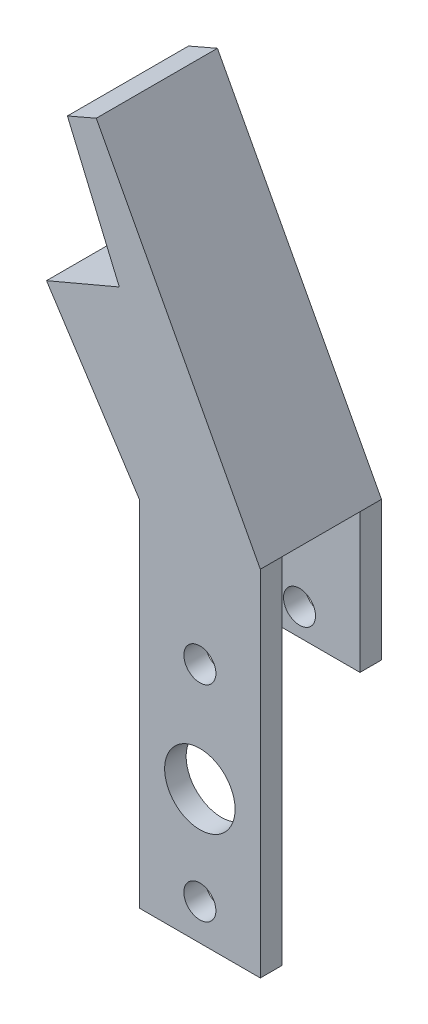
ISO-10303-21;
HEADER;
FILE_DESCRIPTION(('STEP AP214'),'2;1');
FILE_NAME('part.step','',(''),(''),'','','');
FILE_SCHEMA(('AUTOMOTIVE_DESIGN { 1 0 10303 214 1 1 1 1 }'));
ENDSEC;
DATA;
#1=APPLICATION_CONTEXT('core data for automotive mechanical design processes');
#2=APPLICATION_PROTOCOL_DEFINITION('international standard','automotive_design',2000,#1);
#3=PRODUCT_CONTEXT('',#1,'mechanical');
#4=PRODUCT('Part','Part','',(#3));
#5=PRODUCT_RELATED_PRODUCT_CATEGORY('part','',(#4));
#6=PRODUCT_DEFINITION_FORMATION('','',#4);
#7=PRODUCT_DEFINITION_CONTEXT('part definition',#1,'design');
#8=PRODUCT_DEFINITION('design','',#6,#7);
#9=PRODUCT_DEFINITION_SHAPE('','',#8);
#10=(LENGTH_UNIT() NAMED_UNIT(*) SI_UNIT(.MILLI.,.METRE.));
#11=(NAMED_UNIT(*) PLANE_ANGLE_UNIT() SI_UNIT($,.RADIAN.));
#12=(NAMED_UNIT(*) SI_UNIT($,.STERADIAN.) SOLID_ANGLE_UNIT());
#13=UNCERTAINTY_MEASURE_WITH_UNIT(LENGTH_MEASURE(1.E-05),#10,'distance_accuracy_value','');
#14=(GEOMETRIC_REPRESENTATION_CONTEXT(3) GLOBAL_UNCERTAINTY_ASSIGNED_CONTEXT((#13)) GLOBAL_UNIT_ASSIGNED_CONTEXT((#10,
#11,#12)) REPRESENTATION_CONTEXT('',''));
#15=CARTESIAN_POINT('',(0.,0.,0.));
#16=DIRECTION('',(0.,0.,1.));
#17=DIRECTION('',(1.,0.,0.));
#18=AXIS2_PLACEMENT_3D('',#15,#16,#17);
#19=CARTESIAN_POINT('',(-1.59169242895809,-17.7894769762298,14.3256));
#20=DIRECTION('',(1.,0.,0.));
#21=DIRECTION('',(0.,0.,-1.));
#22=AXIS2_PLACEMENT_3D('',#19,#20,#21);
#23=PLANE('',#22);
#24=DIRECTION('',(0.,-1.,0.));
#25=VECTOR('',#24,1.);
#26=CARTESIAN_POINT('',(-1.59169242895809,-17.7894769762298,0.));
#27=LINE('',#26,#25);
#28=CARTESIAN_POINT('',(-1.59169242895809,24.0697230237702,0.));
#29=VERTEX_POINT('',#28);
#30=CARTESIAN_POINT('',(-1.59169242895809,7.61052302377023,0.));
#31=VERTEX_POINT('',#30);
#32=EDGE_CURVE('E143',#29,#31,#27,.T.);
#33=ORIENTED_EDGE('',*,*,#32,.T.);
#34=DIRECTION('',(0.,0.,1.));
#35=VECTOR('',#34,1.);
#36=CARTESIAN_POINT('',(-1.59169242895809,7.61052302377023,14.3256));
#37=LINE('',#36,#35);
#38=CARTESIAN_POINT('',(-1.59169242895809,7.61052302377023,2.54));
#39=VERTEX_POINT('',#38);
#40=EDGE_CURVE('E123',#31,#39,#37,.T.);
#41=ORIENTED_EDGE('',*,*,#40,.T.);
#42=DIRECTION('',(0.,-1.,0.));
#43=VECTOR('',#42,1.);
#44=CARTESIAN_POINT('',(-1.59169242895809,-17.7894769762298,2.54));
#45=LINE('',#44,#43);
#46=CARTESIAN_POINT('',(-1.59169242895809,24.0697230237702,2.54000000000001));
#47=VERTEX_POINT('',#46);
#48=EDGE_CURVE('E147',#47,#39,#45,.T.);
#49=ORIENTED_EDGE('',*,*,#48,.F.);
#50=DIRECTION('',(0.,0.,-1.));
#51=VECTOR('',#50,1.);
#52=CARTESIAN_POINT('',(-1.59169242895809,24.0697230237702,14.3256));
#53=LINE('',#52,#51);
#54=EDGE_CURVE('E165',#47,#29,#53,.T.);
#55=ORIENTED_EDGE('',*,*,#54,.T.);
#56=EDGE_LOOP('',(#33,#41,#49,#55));
#57=FACE_BOUND('',#56,.T.);
#58=ADVANCED_FACE('F33',(#57),#23,.F.);
#59=DIRECTION('',(0.,1.,0.));
#60=VECTOR('',#59,1.);
#61=CARTESIAN_POINT('',(-1.59169242895809,-17.7894769762298,11.7856));
#62=LINE('',#61,#60);
#63=CARTESIAN_POINT('',(-1.59169242895809,-17.7894769762298,11.7856));
#64=VERTEX_POINT('',#63);
#65=CARTESIAN_POINT('',(-1.59169242895809,24.0697230237702,11.7856));
#66=VERTEX_POINT('',#65);
#67=EDGE_CURVE('E219',#64,#66,#62,.T.);
#68=ORIENTED_EDGE('',*,*,#67,.F.);
#69=DIRECTION('',(0.,0.,-1.));
#70=VECTOR('',#69,1.);
#71=CARTESIAN_POINT('',(-1.59169242895809,-17.7894769762298,14.3256));
#72=LINE('',#71,#70);
#73=CARTESIAN_POINT('',(-1.59169242895809,-17.7894769762298,14.3256));
#74=VERTEX_POINT('',#73);
#75=EDGE_CURVE('E41',#74,#64,#72,.T.);
#76=ORIENTED_EDGE('',*,*,#75,.F.);
#77=DIRECTION('',(0.,-1.,0.));
#78=VECTOR('',#77,1.);
#79=CARTESIAN_POINT('',(-1.59169242895809,-17.7894769762298,14.3256));
#80=LINE('',#79,#78);
#81=CARTESIAN_POINT('',(-1.59169242895809,24.0697230237702,14.3256));
#82=VERTEX_POINT('',#81);
#83=EDGE_CURVE('E159',#82,#74,#80,.T.);
#84=ORIENTED_EDGE('',*,*,#83,.F.);
#85=EDGE_CURVE('E160',#82,#66,#53,.T.);
#86=ORIENTED_EDGE('',*,*,#85,.T.);
#87=EDGE_LOOP('',(#68,#76,#84,#86));
#88=FACE_BOUND('',#87,.T.);
#89=ADVANCED_FACE('F285',(#88),#23,.F.);
#90=CARTESIAN_POINT('',(-1.59169242895809,-17.7894769762298,14.3256));
#91=DIRECTION('',(0.,1.,0.));
#92=DIRECTION('',(0.,0.,1.));
#93=AXIS2_PLACEMENT_3D('',#90,#91,#92);
#94=PLANE('',#93);
#95=DIRECTION('',(1.,0.,0.));
#96=VECTOR('',#95,1.);
#97=CARTESIAN_POINT('',(-1.61709242895809,-17.7894769762298,11.7856));
#98=LINE('',#97,#96);
#99=CARTESIAN_POINT('',(12.7085075710419,-17.7894769762298,11.7856));
#100=VERTEX_POINT('',#99);
#101=EDGE_CURVE('E216',#64,#100,#98,.T.);
#102=ORIENTED_EDGE('',*,*,#101,.T.);
#103=DIRECTION('',(0.,0.,-1.));
#104=VECTOR('',#103,1.);
#105=CARTESIAN_POINT('',(12.7085075710419,-17.7894769762298,14.3256));
#106=LINE('',#105,#104);
#107=CARTESIAN_POINT('',(12.7085075710419,-17.7894769762298,14.3256));
#108=VERTEX_POINT('',#107);
#109=EDGE_CURVE('E181',#108,#100,#106,.T.);
#110=ORIENTED_EDGE('',*,*,#109,.F.);
#111=DIRECTION('',(1.,0.,0.));
#112=VECTOR('',#111,1.);
#113=CARTESIAN_POINT('',(-1.59169242895809,-17.7894769762298,14.3256));
#114=LINE('',#113,#112);
#115=EDGE_CURVE('E227',#74,#108,#114,.T.);
#116=ORIENTED_EDGE('',*,*,#115,.F.);
#117=ORIENTED_EDGE('',*,*,#75,.T.);
#118=EDGE_LOOP('',(#102,#110,#116,#117));
#119=FACE_BOUND('',#118,.T.);
#120=ADVANCED_FACE('F281',(#119),#94,.F.);
#121=CARTESIAN_POINT('',(12.7085075710419,-17.7894769762298,14.3256));
#122=DIRECTION('',(-1.,0.,0.));
#123=DIRECTION('',(0.,0.,1.));
#124=AXIS2_PLACEMENT_3D('',#121,#122,#123);
#125=PLANE('',#124);
#126=DIRECTION('',(0.,-1.,0.));
#127=VECTOR('',#126,1.);
#128=CARTESIAN_POINT('',(12.7085075710419,0.,2.54));
#129=LINE('',#128,#127);
#130=CARTESIAN_POINT('',(12.7085075710419,24.0697230237702,2.54000000000001));
#131=VERTEX_POINT('',#130);
#132=CARTESIAN_POINT('',(12.7085075710419,7.61052302377023,2.54));
#133=VERTEX_POINT('',#132);
#134=EDGE_CURVE('E136',#131,#133,#129,.T.);
#135=ORIENTED_EDGE('',*,*,#134,.T.);
#136=DIRECTION('',(0.,0.,1.));
#137=VECTOR('',#136,1.);
#138=CARTESIAN_POINT('',(12.7085075710419,7.61052302377023,0.));
#139=LINE('',#138,#137);
#140=CARTESIAN_POINT('',(12.7085075710419,7.61052302377023,0.));
#141=VERTEX_POINT('',#140);
#142=EDGE_CURVE('E48',#141,#133,#139,.T.);
#143=ORIENTED_EDGE('',*,*,#142,.F.);
#144=DIRECTION('',(0.,1.,0.));
#145=VECTOR('',#144,1.);
#146=CARTESIAN_POINT('',(12.7085075710419,-17.7894769762298,0.));
#147=LINE('',#146,#145);
#148=CARTESIAN_POINT('',(12.7085075710419,24.0697230237702,0.));
#149=VERTEX_POINT('',#148);
#150=EDGE_CURVE('E133',#141,#149,#147,.T.);
#151=ORIENTED_EDGE('',*,*,#150,.T.);
#152=DIRECTION('',(0.,0.,-1.));
#153=VECTOR('',#152,1.);
#154=CARTESIAN_POINT('',(12.7085075710419,24.0697230237702,14.3256));
#155=LINE('',#154,#153);
#156=EDGE_CURVE('E177',#131,#149,#155,.T.);
#157=ORIENTED_EDGE('',*,*,#156,.F.);
#158=EDGE_LOOP('',(#135,#143,#151,#157));
#159=FACE_BOUND('',#158,.T.);
#160=ADVANCED_FACE('F131',(#159),#125,.F.);
#161=DIRECTION('',(0.,1.,0.));
#162=VECTOR('',#161,1.);
#163=CARTESIAN_POINT('',(12.7085075710419,0.,11.7856));
#164=LINE('',#163,#162);
#165=CARTESIAN_POINT('',(12.7085075710419,24.0697230237702,11.7856));
#166=VERTEX_POINT('',#165);
#167=EDGE_CURVE('E212',#100,#166,#164,.T.);
#168=ORIENTED_EDGE('',*,*,#167,.T.);
#169=CARTESIAN_POINT('',(12.7085075710419,24.0697230237702,14.3256));
#170=VERTEX_POINT('',#169);
#171=EDGE_CURVE('E178',#170,#166,#155,.T.);
#172=ORIENTED_EDGE('',*,*,#171,.F.);
#173=DIRECTION('',(0.,1.,0.));
#174=VECTOR('',#173,1.);
#175=CARTESIAN_POINT('',(12.7085075710419,-17.7894769762298,14.3256));
#176=LINE('',#175,#174);
#177=EDGE_CURVE('E229',#108,#170,#176,.T.);
#178=ORIENTED_EDGE('',*,*,#177,.F.);
#179=ORIENTED_EDGE('',*,*,#109,.T.);
#180=EDGE_LOOP('',(#168,#172,#178,#179));
#181=FACE_BOUND('',#180,.T.);
#182=ADVANCED_FACE('F274',(#181),#125,.F.);
#183=CARTESIAN_POINT('',(12.7085075710419,24.0697230237702,14.3256));
#184=DIRECTION('',(-0.882947592858925,-0.469471562785895,0.));
#185=DIRECTION('',(0.469471562785895,-0.882947592858925,0.));
#186=AXIS2_PLACEMENT_3D('',#183,#184,#185);
#187=PLANE('',#186);
#188=DIRECTION('',(-0.469471562785895,0.882947592858924,0.));
#189=VECTOR('',#188,1.);
#190=CARTESIAN_POINT('',(12.7085075710419,24.0697230237702,0.));
#191=LINE('',#190,#189);
#192=CARTESIAN_POINT('',(-6.69278033833544,60.5582386567396,0.));
#193=VERTEX_POINT('',#192);
#194=EDGE_CURVE('E142',#149,#193,#191,.T.);
#195=ORIENTED_EDGE('',*,*,#194,.T.);
#196=DIRECTION('',(0.,0.,-1.));
#197=VECTOR('',#196,1.);
#198=CARTESIAN_POINT('',(-6.69278033833544,60.5582386567396,14.3256));
#199=LINE('',#198,#197);
#200=CARTESIAN_POINT('',(-6.69278033833544,60.5582386567396,14.3256));
#201=VERTEX_POINT('',#200);
#202=EDGE_CURVE('E174',#201,#193,#199,.T.);
#203=ORIENTED_EDGE('',*,*,#202,.F.);
#204=DIRECTION('',(-0.469471562785895,0.882947592858924,0.));
#205=VECTOR('',#204,1.);
#206=CARTESIAN_POINT('',(12.7085075710419,24.0697230237702,14.3256));
#207=LINE('',#206,#205);
#208=EDGE_CURVE('E231',#170,#201,#207,.T.);
#209=ORIENTED_EDGE('',*,*,#208,.F.);
#210=ORIENTED_EDGE('',*,*,#171,.T.);
#211=DIRECTION('',(0.,0.,1.));
#212=VECTOR('',#211,1.);
#213=CARTESIAN_POINT('',(12.7085075710419,24.0697230237702,0.));
#214=LINE('',#213,#212);
#215=EDGE_CURVE('E210',#131,#166,#214,.T.);
#216=ORIENTED_EDGE('',*,*,#215,.F.);
#217=ORIENTED_EDGE('',*,*,#156,.T.);
#218=EDGE_LOOP('',(#195,#203,#209,#210,#216,#217));
#219=FACE_BOUND('',#218,.T.);
#220=ADVANCED_FACE('F270',(#219),#187,.F.);
#221=CARTESIAN_POINT('',(-10.1049963354584,59.0852863596951,14.3256));
#222=DIRECTION('',(0.396321577939323,-0.9181117616389,0.));
#223=DIRECTION('',(0.9181117616389,0.396321577939323,0.));
#224=AXIS2_PLACEMENT_3D('',#221,#222,#223);
#225=PLANE('',#224);
#226=DIRECTION('',(-0.9181117616389,-0.396321577939323,0.));
#227=VECTOR('',#226,1.);
#228=CARTESIAN_POINT('',(-10.1049963354584,59.0852863596951,0.));
#229=LINE('',#228,#227);
#230=CARTESIAN_POINT('',(-10.1049963354584,59.0852863596951,0.));
#231=VERTEX_POINT('',#230);
#232=EDGE_CURVE('E145',#193,#231,#229,.T.);
#233=ORIENTED_EDGE('',*,*,#232,.T.);
#234=DIRECTION('',(0.,0.,-1.));
#235=VECTOR('',#234,1.);
#236=CARTESIAN_POINT('',(-10.1049963354584,59.0852863596951,14.3256));
#237=LINE('',#236,#235);
#238=CARTESIAN_POINT('',(-10.1049963354584,59.0852863596951,14.3256));
#239=VERTEX_POINT('',#238);
#240=EDGE_CURVE('E171',#239,#231,#237,.T.);
#241=ORIENTED_EDGE('',*,*,#240,.F.);
#242=DIRECTION('',(-0.9181117616389,-0.396321577939323,0.));
#243=VECTOR('',#242,1.);
#244=CARTESIAN_POINT('',(-10.1049963354584,59.0852863596951,14.3256));
#245=LINE('',#244,#243);
#246=EDGE_CURVE('E233',#201,#239,#245,.T.);
#247=ORIENTED_EDGE('',*,*,#246,.F.);
#248=ORIENTED_EDGE('',*,*,#202,.T.);
#249=EDGE_LOOP('',(#233,#241,#247,#248));
#250=FACE_BOUND('',#249,.T.);
#251=ADVANCED_FACE('F266',(#250),#225,.F.);
#252=CARTESIAN_POINT('',(-3.97161166533666,44.6359375740814,14.3256));
#253=DIRECTION('',(0.920504853452444,0.390731128489265,0.));
#254=DIRECTION('',(-0.390731128489265,0.920504853452444,0.));
#255=AXIS2_PLACEMENT_3D('',#252,#253,#254);
#256=PLANE('',#255);
#257=DIRECTION('',(0.390731128489265,-0.920504853452444,0.));
#258=VECTOR('',#257,1.);
#259=CARTESIAN_POINT('',(-3.97161166533666,44.6359375740814,0.));
#260=LINE('',#259,#258);
#261=CARTESIAN_POINT('',(-3.97161166533666,44.6359375740814,0.));
#262=VERTEX_POINT('',#261);
#263=EDGE_CURVE('E152',#231,#262,#260,.T.);
#264=ORIENTED_EDGE('',*,*,#263,.T.);
#265=DIRECTION('',(0.,0.,-1.));
#266=VECTOR('',#265,1.);
#267=CARTESIAN_POINT('',(-3.97161166533666,44.6359375740814,14.3256));
#268=LINE('',#267,#266);
#269=CARTESIAN_POINT('',(-3.97161166533666,44.6359375740814,14.3256));
#270=VERTEX_POINT('',#269);
#271=EDGE_CURVE('E168',#270,#262,#268,.T.);
#272=ORIENTED_EDGE('',*,*,#271,.F.);
#273=DIRECTION('',(0.390731128489265,-0.920504853452444,0.));
#274=VECTOR('',#273,1.);
#275=CARTESIAN_POINT('',(-3.97161166533666,44.6359375740814,14.3256));
#276=LINE('',#275,#274);
#277=EDGE_CURVE('E235',#239,#270,#276,.T.);
#278=ORIENTED_EDGE('',*,*,#277,.F.);
#279=ORIENTED_EDGE('',*,*,#240,.T.);
#280=EDGE_LOOP('',(#264,#272,#278,#279));
#281=FACE_BOUND('',#280,.T.);
#282=ADVANCED_FACE('F262',(#281),#256,.F.);
#283=CARTESIAN_POINT('',(-12.5757546315272,40.9836955698663,14.3256));
#284=DIRECTION('',(0.390731128489291,-0.920504853452433,0.));
#285=DIRECTION('',(0.920504853452433,0.390731128489291,0.));
#286=AXIS2_PLACEMENT_3D('',#283,#284,#285);
#287=PLANE('',#286);
#288=DIRECTION('',(-0.920504853452433,-0.390731128489291,0.));
#289=VECTOR('',#288,1.);
#290=CARTESIAN_POINT('',(-12.5757546315272,40.9836955698663,0.));
#291=LINE('',#290,#289);
#292=CARTESIAN_POINT('',(-12.5757546315272,40.9836955698663,0.));
#293=VERTEX_POINT('',#292);
#294=EDGE_CURVE('E154',#262,#293,#291,.T.);
#295=ORIENTED_EDGE('',*,*,#294,.T.);
#296=DIRECTION('',(0.,0.,-1.));
#297=VECTOR('',#296,1.);
#298=CARTESIAN_POINT('',(-12.5757546315272,40.9836955698663,14.3256));
#299=LINE('',#298,#297);
#300=CARTESIAN_POINT('',(-12.5757546315272,40.9836955698663,14.3256));
#301=VERTEX_POINT('',#300);
#302=EDGE_CURVE('E163',#301,#293,#299,.T.);
#303=ORIENTED_EDGE('',*,*,#302,.F.);
#304=DIRECTION('',(-0.920504853452433,-0.390731128489291,0.));
#305=VECTOR('',#304,1.);
#306=CARTESIAN_POINT('',(-12.5757546315272,40.9836955698663,14.3256));
#307=LINE('',#306,#305);
#308=EDGE_CURVE('E237',#270,#301,#307,.T.);
#309=ORIENTED_EDGE('',*,*,#308,.F.);
#310=ORIENTED_EDGE('',*,*,#271,.T.);
#311=EDGE_LOOP('',(#295,#303,#309,#310));
#312=FACE_BOUND('',#311,.T.);
#313=ADVANCED_FACE('F257',(#312),#287,.F.);
#314=CARTESIAN_POINT('',(-1.59169242895809,24.0697230237702,14.3256));
#315=DIRECTION('',(0.838670567945421,0.544639035015031,0.));
#316=DIRECTION('',(-0.544639035015031,0.838670567945421,0.));
#317=AXIS2_PLACEMENT_3D('',#314,#315,#316);
#318=PLANE('',#317);
#319=DIRECTION('',(0.544639035015031,-0.838670567945421,0.));
#320=VECTOR('',#319,1.);
#321=CARTESIAN_POINT('',(-1.59169242895809,24.0697230237702,0.));
#322=LINE('',#321,#320);
#323=EDGE_CURVE('E156',#293,#29,#322,.T.);
#324=ORIENTED_EDGE('',*,*,#323,.T.);
#325=ORIENTED_EDGE('',*,*,#54,.F.);
#326=EDGE_CURVE('E164',#66,#47,#53,.T.);
#327=ORIENTED_EDGE('',*,*,#326,.F.);
#328=ORIENTED_EDGE('',*,*,#85,.F.);
#329=DIRECTION('',(0.544639035015031,-0.838670567945421,0.));
#330=VECTOR('',#329,1.);
#331=CARTESIAN_POINT('',(-1.59169242895809,24.0697230237702,14.3256));
#332=LINE('',#331,#330);
#333=EDGE_CURVE('E238',#301,#82,#332,.T.);
#334=ORIENTED_EDGE('',*,*,#333,.F.);
#335=ORIENTED_EDGE('',*,*,#302,.T.);
#336=EDGE_LOOP('',(#324,#325,#327,#328,#334,#335));
#337=FACE_BOUND('',#336,.T.);
#338=ADVANCED_FACE('F251',(#337),#318,.F.);
#339=CARTESIAN_POINT('',(0.,0.,14.3256));
#340=DIRECTION('',(0.,0.,-1.));
#341=DIRECTION('',(-1.,0.,0.));
#342=AXIS2_PLACEMENT_3D('',#339,#340,#341);
#343=PLANE('',#342);
#344=CARTESIAN_POINT('',(5.55840757104191,-2.01607697622977,14.3256));
#345=DIRECTION('',(0.,0.,1.));
#346=DIRECTION('',(1.,0.,0.));
#347=AXIS2_PLACEMENT_3D('',#344,#345,#346);
#348=CIRCLE('',#347,4.1656);
#349=CARTESIAN_POINT('',(9.72400757104191,-2.01607697622977,14.3256));
#350=VERTEX_POINT('',#349);
#351=EDGE_CURVE('E204',#350,#350,#348,.T.);
#352=ORIENTED_EDGE('',*,*,#351,.F.);
#353=EDGE_LOOP('',(#352));
#354=FACE_BOUND('',#353,.T.);
#355=CARTESIAN_POINT('',(5.55840757104191,10.7601230237702,14.3256));
#356=DIRECTION('',(0.,0.,1.));
#357=DIRECTION('',(1.,0.,0.));
#358=AXIS2_PLACEMENT_3D('',#355,#356,#357);
#359=CIRCLE('',#358,1.8923);
#360=CARTESIAN_POINT('',(7.45070757104191,10.7601230237702,14.3256));
#361=VERTEX_POINT('',#360);
#362=EDGE_CURVE('E197',#361,#361,#359,.T.);
#363=ORIENTED_EDGE('',*,*,#362,.F.);
#364=EDGE_LOOP('',(#363));
#365=FACE_BOUND('',#364,.T.);
#366=CARTESIAN_POINT('',(5.55840757104191,-13.5222769762298,14.3256));
#367=DIRECTION('',(0.,0.,1.));
#368=DIRECTION('',(1.,0.,0.));
#369=AXIS2_PLACEMENT_3D('',#366,#367,#368);
#370=CIRCLE('',#369,1.8923);
#371=CARTESIAN_POINT('',(7.45070757104191,-13.5222769762298,14.3256));
#372=VERTEX_POINT('',#371);
#373=EDGE_CURVE('E187',#372,#372,#370,.T.);
#374=ORIENTED_EDGE('',*,*,#373,.F.);
#375=EDGE_LOOP('',(#374));
#376=FACE_BOUND('',#375,.T.);
#377=ORIENTED_EDGE('',*,*,#83,.T.);
#378=ORIENTED_EDGE('',*,*,#115,.T.);
#379=ORIENTED_EDGE('',*,*,#177,.T.);
#380=ORIENTED_EDGE('',*,*,#208,.T.);
#381=ORIENTED_EDGE('',*,*,#246,.T.);
#382=ORIENTED_EDGE('',*,*,#277,.T.);
#383=ORIENTED_EDGE('',*,*,#308,.T.);
#384=ORIENTED_EDGE('',*,*,#333,.T.);
#385=EDGE_LOOP('',(#377,#378,#379,#380,#381,#382,#383,#384));
#386=FACE_BOUND('',#385,.T.);
#387=ADVANCED_FACE('F286',(#354,#365,#376,#386),#343,.F.);
#388=CARTESIAN_POINT('',(0.,0.,0.));
#389=DIRECTION('',(0.,0.,-1.));
#390=DIRECTION('',(-1.,0.,0.));
#391=AXIS2_PLACEMENT_3D('',#388,#389,#390);
#392=PLANE('',#391);
#393=CARTESIAN_POINT('',(5.55840757104191,10.7601230237702,0.));
#394=DIRECTION('',(0.,0.,1.));
#395=DIRECTION('',(1.,0.,0.));
#396=AXIS2_PLACEMENT_3D('',#393,#394,#395);
#397=CIRCLE('',#396,1.8923);
#398=CARTESIAN_POINT('',(7.45070757104191,10.7601230237702,0.));
#399=VERTEX_POINT('',#398);
#400=EDGE_CURVE('E191',#399,#399,#397,.T.);
#401=ORIENTED_EDGE('',*,*,#400,.T.);
#402=EDGE_LOOP('',(#401));
#403=FACE_BOUND('',#402,.T.);
#404=DIRECTION('',(1.,0.,0.));
#405=VECTOR('',#404,1.);
#406=CARTESIAN_POINT('',(-1.61709242895809,7.61052302377023,0.));
#407=LINE('',#406,#405);
#408=EDGE_CURVE('E120',#31,#141,#407,.T.);
#409=ORIENTED_EDGE('',*,*,#408,.F.);
#410=ORIENTED_EDGE('',*,*,#32,.F.);
#411=ORIENTED_EDGE('',*,*,#323,.F.);
#412=ORIENTED_EDGE('',*,*,#294,.F.);
#413=ORIENTED_EDGE('',*,*,#263,.F.);
#414=ORIENTED_EDGE('',*,*,#232,.F.);
#415=ORIENTED_EDGE('',*,*,#194,.F.);
#416=ORIENTED_EDGE('',*,*,#150,.F.);
#417=EDGE_LOOP('',(#409,#410,#411,#412,#413,#414,#415,#416));
#418=FACE_BOUND('',#417,.T.);
#419=ADVANCED_FACE('F140',(#403,#418),#392,.T.);
#420=CARTESIAN_POINT('',(-1.61709242895809,0.,2.54));
#421=DIRECTION('',(0.,0.,1.));
#422=DIRECTION('',(0.,-1.,0.));
#423=AXIS2_PLACEMENT_3D('',#420,#421,#422);
#424=PLANE('',#423);
#425=CARTESIAN_POINT('',(5.55840757104191,10.7601230237702,2.54));
#426=DIRECTION('',(0.,0.,1.));
#427=DIRECTION('',(0.,-1.,0.));
#428=AXIS2_PLACEMENT_3D('',#425,#426,#427);
#429=CIRCLE('',#428,1.8923);
#430=CARTESIAN_POINT('',(5.55840757104191,8.86782302377023,2.54));
#431=VERTEX_POINT('',#430);
#432=EDGE_CURVE('E190',#431,#431,#429,.T.);
#433=ORIENTED_EDGE('',*,*,#432,.F.);
#434=EDGE_LOOP('',(#433));
#435=FACE_BOUND('',#434,.T.);
#436=DIRECTION('',(-1.,0.,0.));
#437=VECTOR('',#436,1.);
#438=CARTESIAN_POINT('',(-1.61709242895809,7.61052302377023,2.54));
#439=LINE('',#438,#437);
#440=EDGE_CURVE('E11',#133,#39,#439,.T.);
#441=ORIENTED_EDGE('',*,*,#440,.F.);
#442=ORIENTED_EDGE('',*,*,#134,.F.);
#443=DIRECTION('',(1.,0.,0.));
#444=VECTOR('',#443,1.);
#445=CARTESIAN_POINT('',(-1.61709242895809,24.0697230237702,2.54000000000001));
#446=LINE('',#445,#444);
#447=EDGE_CURVE('E215',#47,#131,#446,.T.);
#448=ORIENTED_EDGE('',*,*,#447,.F.);
#449=ORIENTED_EDGE('',*,*,#48,.T.);
#450=EDGE_LOOP('',(#441,#442,#448,#449));
#451=FACE_BOUND('',#450,.T.);
#452=ADVANCED_FACE('F250',(#435,#451),#424,.T.);
#453=CARTESIAN_POINT('',(-1.61709242895809,0.,11.7856));
#454=DIRECTION('',(0.,0.,-1.));
#455=DIRECTION('',(-1.,0.,0.));
#456=AXIS2_PLACEMENT_3D('',#453,#454,#455);
#457=PLANE('',#456);
#458=CARTESIAN_POINT('',(5.55840757104191,-2.01607697622977,11.7856));
#459=DIRECTION('',(0.,0.,-1.));
#460=DIRECTION('',(-1.,0.,0.));
#461=AXIS2_PLACEMENT_3D('',#458,#459,#460);
#462=CIRCLE('',#461,4.1656);
#463=CARTESIAN_POINT('',(1.39280757104191,-2.01607697622977,11.7856));
#464=VERTEX_POINT('',#463);
#465=EDGE_CURVE('E36',#464,#464,#462,.T.);
#466=ORIENTED_EDGE('',*,*,#465,.F.);
#467=EDGE_LOOP('',(#466));
#468=FACE_BOUND('',#467,.T.);
#469=CARTESIAN_POINT('',(5.55840757104191,10.7601230237702,11.7856));
#470=DIRECTION('',(0.,0.,-1.));
#471=DIRECTION('',(-1.,0.,0.));
#472=AXIS2_PLACEMENT_3D('',#469,#470,#471);
#473=CIRCLE('',#472,1.8923);
#474=CARTESIAN_POINT('',(3.66610757104191,10.7601230237702,11.7856));
#475=VERTEX_POINT('',#474);
#476=EDGE_CURVE('E188',#475,#475,#473,.T.);
#477=ORIENTED_EDGE('',*,*,#476,.F.);
#478=EDGE_LOOP('',(#477));
#479=FACE_BOUND('',#478,.T.);
#480=CARTESIAN_POINT('',(5.55840757104191,-13.5222769762298,11.7856));
#481=DIRECTION('',(0.,0.,-1.));
#482=DIRECTION('',(-1.,0.,0.));
#483=AXIS2_PLACEMENT_3D('',#480,#481,#482);
#484=CIRCLE('',#483,1.8923);
#485=CARTESIAN_POINT('',(3.66610757104191,-13.5222769762298,11.7856));
#486=VERTEX_POINT('',#485);
#487=EDGE_CURVE('E137',#486,#486,#484,.T.);
#488=ORIENTED_EDGE('',*,*,#487,.F.);
#489=EDGE_LOOP('',(#488));
#490=FACE_BOUND('',#489,.T.);
#491=ORIENTED_EDGE('',*,*,#67,.T.);
#492=DIRECTION('',(1.,0.,0.));
#493=VECTOR('',#492,1.);
#494=CARTESIAN_POINT('',(-1.61709242895809,24.0697230237702,11.7856));
#495=LINE('',#494,#493);
#496=EDGE_CURVE('E56',#66,#166,#495,.T.);
#497=ORIENTED_EDGE('',*,*,#496,.T.);
#498=ORIENTED_EDGE('',*,*,#167,.F.);
#499=ORIENTED_EDGE('',*,*,#101,.F.);
#500=EDGE_LOOP('',(#491,#497,#498,#499));
#501=FACE_BOUND('',#500,.T.);
#502=ADVANCED_FACE('F278',(#468,#479,#490,#501),#457,.T.);
#503=CARTESIAN_POINT('',(-1.61709242895809,24.0697230237702,0.));
#504=DIRECTION('',(0.,1.,0.));
#505=DIRECTION('',(0.,0.,1.));
#506=AXIS2_PLACEMENT_3D('',#503,#504,#505);
#507=PLANE('',#506);
#508=ORIENTED_EDGE('',*,*,#447,.T.);
#509=ORIENTED_EDGE('',*,*,#215,.T.);
#510=ORIENTED_EDGE('',*,*,#496,.F.);
#511=ORIENTED_EDGE('',*,*,#326,.T.);
#512=EDGE_LOOP('',(#508,#509,#510,#511));
#513=FACE_BOUND('',#512,.T.);
#514=ADVANCED_FACE('F247',(#513),#507,.F.);
#515=CARTESIAN_POINT('',(-1.61709242895809,7.61052302377023,0.));
#516=DIRECTION('',(0.,1.,0.));
#517=DIRECTION('',(0.,0.,1.));
#518=AXIS2_PLACEMENT_3D('',#515,#516,#517);
#519=PLANE('',#518);
#520=ORIENTED_EDGE('',*,*,#408,.T.);
#521=ORIENTED_EDGE('',*,*,#142,.T.);
#522=ORIENTED_EDGE('',*,*,#440,.T.);
#523=ORIENTED_EDGE('',*,*,#40,.F.);
#524=EDGE_LOOP('',(#520,#521,#522,#523));
#525=FACE_BOUND('',#524,.T.);
#526=ADVANCED_FACE('F121',(#525),#519,.F.);
#527=CARTESIAN_POINT('',(5.55840757104191,-13.5222769762298,0.));
#528=DIRECTION('',(0.,0.,1.));
#529=DIRECTION('',(1.,0.,0.));
#530=AXIS2_PLACEMENT_3D('',#527,#528,#529);
#531=CYLINDRICAL_SURFACE('',#530,1.8923);
#532=ORIENTED_EDGE('',*,*,#487,.T.);
#533=EDGE_LOOP('',(#532));
#534=FACE_BOUND('',#533,.T.);
#535=ORIENTED_EDGE('',*,*,#373,.T.);
#536=EDGE_LOOP('',(#535));
#537=FACE_BOUND('',#536,.T.);
#538=ADVANCED_FACE('F365',(#534,#537),#531,.F.);
#539=CARTESIAN_POINT('',(5.55840757104191,10.7601230237702,0.));
#540=DIRECTION('',(0.,0.,1.));
#541=DIRECTION('',(1.,0.,0.));
#542=AXIS2_PLACEMENT_3D('',#539,#540,#541);
#543=CYLINDRICAL_SURFACE('',#542,1.8923);
#544=ORIENTED_EDGE('',*,*,#476,.T.);
#545=EDGE_LOOP('',(#544));
#546=FACE_BOUND('',#545,.T.);
#547=ORIENTED_EDGE('',*,*,#362,.T.);
#548=EDGE_LOOP('',(#547));
#549=FACE_BOUND('',#548,.T.);
#550=ADVANCED_FACE('F402',(#546,#549),#543,.F.);
#551=ORIENTED_EDGE('',*,*,#432,.T.);
#552=EDGE_LOOP('',(#551));
#553=FACE_BOUND('',#552,.T.);
#554=ORIENTED_EDGE('',*,*,#400,.F.);
#555=EDGE_LOOP('',(#554));
#556=FACE_BOUND('',#555,.T.);
#557=ADVANCED_FACE('F412',(#553,#556),#543,.F.);
#558=CARTESIAN_POINT('',(5.55840757104191,-2.01607697622977,0.));
#559=DIRECTION('',(0.,0.,1.));
#560=DIRECTION('',(1.,0.,0.));
#561=AXIS2_PLACEMENT_3D('',#558,#559,#560);
#562=CYLINDRICAL_SURFACE('',#561,4.1656);
#563=ORIENTED_EDGE('',*,*,#465,.T.);
#564=EDGE_LOOP('',(#563));
#565=FACE_BOUND('',#564,.T.);
#566=ORIENTED_EDGE('',*,*,#351,.T.);
#567=EDGE_LOOP('',(#566));
#568=FACE_BOUND('',#567,.T.);
#569=ADVANCED_FACE('F421',(#565,#568),#562,.F.);
#570=CLOSED_SHELL('',(#58,#89,#120,#160,#182,#220,#251,#282,#313,#338,#387,#419,#452,#502,#514,
#526,#538,#550,#557,#569));
#571=MANIFOLD_SOLID_BREP('B2',#570);
#572=ADVANCED_BREP_SHAPE_REPRESENTATION('',(#18,#571),#14);
#573=SHAPE_DEFINITION_REPRESENTATION(#9,#572);
ENDSEC;
END-ISO-10303-21;
